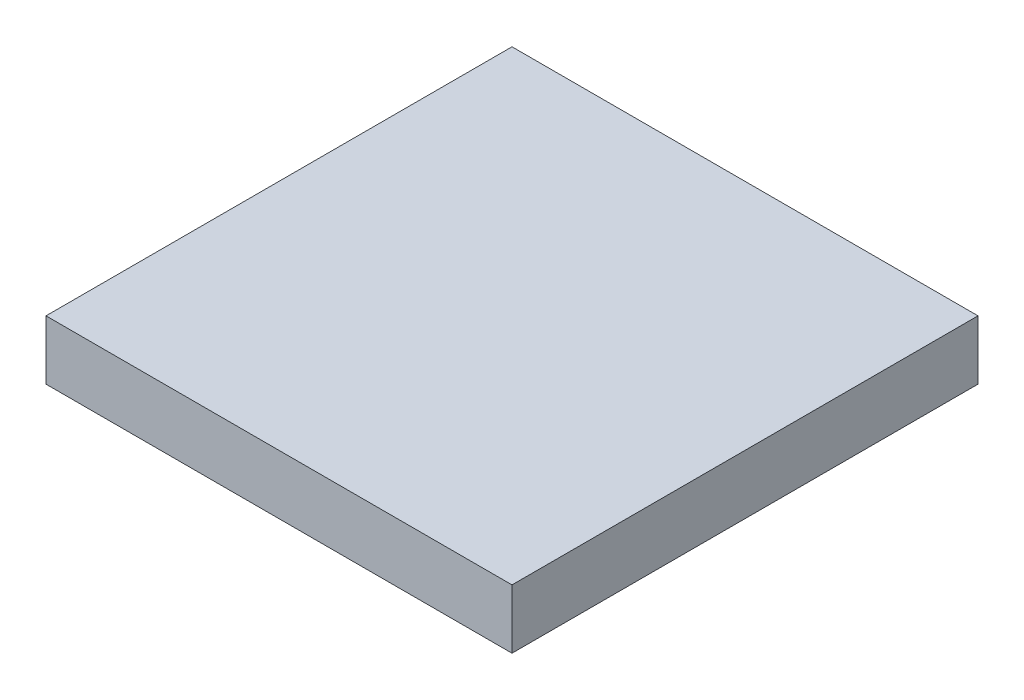
ISO-10303-21;
HEADER;
FILE_DESCRIPTION(('STEP AP214'),'2;1');
FILE_NAME('part.step','',(''),(''),'','','');
FILE_SCHEMA(('AUTOMOTIVE_DESIGN { 1 0 10303 214 1 1 1 1 }'));
ENDSEC;
DATA;
#1=APPLICATION_CONTEXT('core data for automotive mechanical design processes');
#2=APPLICATION_PROTOCOL_DEFINITION('international standard','automotive_design',2000,#1);
#3=PRODUCT_CONTEXT('',#1,'mechanical');
#4=PRODUCT('Part','Part','',(#3));
#5=PRODUCT_RELATED_PRODUCT_CATEGORY('part','',(#4));
#6=PRODUCT_DEFINITION_FORMATION('','',#4);
#7=PRODUCT_DEFINITION_CONTEXT('part definition',#1,'design');
#8=PRODUCT_DEFINITION('design','',#6,#7);
#9=PRODUCT_DEFINITION_SHAPE('','',#8);
#10=(LENGTH_UNIT() NAMED_UNIT(*) SI_UNIT(.MILLI.,.METRE.));
#11=(NAMED_UNIT(*) PLANE_ANGLE_UNIT() SI_UNIT($,.RADIAN.));
#12=(NAMED_UNIT(*) SI_UNIT($,.STERADIAN.) SOLID_ANGLE_UNIT());
#13=UNCERTAINTY_MEASURE_WITH_UNIT(LENGTH_MEASURE(1.E-05),#10,'distance_accuracy_value','');
#14=(GEOMETRIC_REPRESENTATION_CONTEXT(3) GLOBAL_UNCERTAINTY_ASSIGNED_CONTEXT((#13)) GLOBAL_UNIT_ASSIGNED_CONTEXT((#10,
#11,#12)) REPRESENTATION_CONTEXT('',''));
#15=CARTESIAN_POINT('',(0.,0.,0.));
#16=DIRECTION('',(0.,0.,1.));
#17=DIRECTION('',(1.,0.,0.));
#18=AXIS2_PLACEMENT_3D('',#15,#16,#17);
#19=CARTESIAN_POINT('',(50.,12.7,50.));
#20=DIRECTION('',(-1.,0.,0.));
#21=DIRECTION('',(0.,0.,1.));
#22=AXIS2_PLACEMENT_3D('',#19,#20,#21);
#23=PLANE('',#22);
#24=DIRECTION('',(0.,0.,-1.));
#25=VECTOR('',#24,1.);
#26=CARTESIAN_POINT('',(50.,0.,50.));
#27=LINE('',#26,#25);
#28=CARTESIAN_POINT('',(50.,0.,50.));
#29=VERTEX_POINT('',#28);
#30=CARTESIAN_POINT('',(50.,0.,-50.));
#31=VERTEX_POINT('',#30);
#32=EDGE_CURVE('E113',#29,#31,#27,.T.);
#33=ORIENTED_EDGE('',*,*,#32,.T.);
#34=DIRECTION('',(0.,-1.,0.));
#35=VECTOR('',#34,1.);
#36=CARTESIAN_POINT('',(50.,12.7,-50.));
#37=LINE('',#36,#35);
#38=CARTESIAN_POINT('',(50.,12.7,-50.));
#39=VERTEX_POINT('',#38);
#40=EDGE_CURVE('E11',#39,#31,#37,.T.);
#41=ORIENTED_EDGE('',*,*,#40,.F.);
#42=DIRECTION('',(0.,0.,-1.));
#43=VECTOR('',#42,1.);
#44=CARTESIAN_POINT('',(50.,12.7,50.));
#45=LINE('',#44,#43);
#46=CARTESIAN_POINT('',(50.,12.7,50.));
#47=VERTEX_POINT('',#46);
#48=EDGE_CURVE('E97',#47,#39,#45,.T.);
#49=ORIENTED_EDGE('',*,*,#48,.F.);
#50=DIRECTION('',(0.,-1.,0.));
#51=VECTOR('',#50,1.);
#52=CARTESIAN_POINT('',(50.,12.7,50.));
#53=LINE('',#52,#51);
#54=EDGE_CURVE('E109',#47,#29,#53,.T.);
#55=ORIENTED_EDGE('',*,*,#54,.T.);
#56=EDGE_LOOP('',(#33,#41,#49,#55));
#57=FACE_BOUND('',#56,.T.);
#58=ADVANCED_FACE('F45',(#57),#23,.F.);
#59=CARTESIAN_POINT('',(-50.,12.7,-50.));
#60=DIRECTION('',(0.,0.,1.));
#61=DIRECTION('',(1.,0.,0.));
#62=AXIS2_PLACEMENT_3D('',#59,#60,#61);
#63=PLANE('',#62);
#64=DIRECTION('',(-1.,0.,0.));
#65=VECTOR('',#64,1.);
#66=CARTESIAN_POINT('',(-50.,0.,-50.));
#67=LINE('',#66,#65);
#68=CARTESIAN_POINT('',(-50.,0.,-50.));
#69=VERTEX_POINT('',#68);
#70=EDGE_CURVE('E102',#31,#69,#67,.T.);
#71=ORIENTED_EDGE('',*,*,#70,.T.);
#72=DIRECTION('',(0.,-1.,0.));
#73=VECTOR('',#72,1.);
#74=CARTESIAN_POINT('',(-50.,12.7,-50.));
#75=LINE('',#74,#73);
#76=CARTESIAN_POINT('',(-50.,12.7,-50.));
#77=VERTEX_POINT('',#76);
#78=EDGE_CURVE('E54',#77,#69,#75,.T.);
#79=ORIENTED_EDGE('',*,*,#78,.F.);
#80=DIRECTION('',(-1.,0.,0.));
#81=VECTOR('',#80,1.);
#82=CARTESIAN_POINT('',(-50.,12.7,-50.));
#83=LINE('',#82,#81);
#84=EDGE_CURVE('E92',#39,#77,#83,.T.);
#85=ORIENTED_EDGE('',*,*,#84,.F.);
#86=ORIENTED_EDGE('',*,*,#40,.T.);
#87=EDGE_LOOP('',(#71,#79,#85,#86));
#88=FACE_BOUND('',#87,.T.);
#89=ADVANCED_FACE('F101',(#88),#63,.F.);
#90=CARTESIAN_POINT('',(-50.,12.7,50.));
#91=DIRECTION('',(1.,0.,0.));
#92=DIRECTION('',(0.,0.,-1.));
#93=AXIS2_PLACEMENT_3D('',#90,#91,#92);
#94=PLANE('',#93);
#95=DIRECTION('',(0.,0.,1.));
#96=VECTOR('',#95,1.);
#97=CARTESIAN_POINT('',(-50.,0.,50.));
#98=LINE('',#97,#96);
#99=CARTESIAN_POINT('',(-50.,0.,50.));
#100=VERTEX_POINT('',#99);
#101=EDGE_CURVE('E79',#69,#100,#98,.T.);
#102=ORIENTED_EDGE('',*,*,#101,.T.);
#103=DIRECTION('',(0.,-1.,0.));
#104=VECTOR('',#103,1.);
#105=CARTESIAN_POINT('',(-50.,12.7,50.));
#106=LINE('',#105,#104);
#107=CARTESIAN_POINT('',(-50.,12.7,50.));
#108=VERTEX_POINT('',#107);
#109=EDGE_CURVE('E104',#108,#100,#106,.T.);
#110=ORIENTED_EDGE('',*,*,#109,.F.);
#111=DIRECTION('',(0.,0.,1.));
#112=VECTOR('',#111,1.);
#113=CARTESIAN_POINT('',(-50.,12.7,50.));
#114=LINE('',#113,#112);
#115=EDGE_CURVE('E95',#77,#108,#114,.T.);
#116=ORIENTED_EDGE('',*,*,#115,.F.);
#117=ORIENTED_EDGE('',*,*,#78,.T.);
#118=EDGE_LOOP('',(#102,#110,#116,#117));
#119=FACE_BOUND('',#118,.T.);
#120=ADVANCED_FACE('F105',(#119),#94,.F.);
#121=CARTESIAN_POINT('',(-50.,12.7,50.));
#122=DIRECTION('',(0.,0.,-1.));
#123=DIRECTION('',(-1.,0.,0.));
#124=AXIS2_PLACEMENT_3D('',#121,#122,#123);
#125=PLANE('',#124);
#126=DIRECTION('',(1.,0.,0.));
#127=VECTOR('',#126,1.);
#128=CARTESIAN_POINT('',(-50.,0.,50.));
#129=LINE('',#128,#127);
#130=EDGE_CURVE('E85',#100,#29,#129,.T.);
#131=ORIENTED_EDGE('',*,*,#130,.T.);
#132=ORIENTED_EDGE('',*,*,#54,.F.);
#133=DIRECTION('',(1.,0.,0.));
#134=VECTOR('',#133,1.);
#135=CARTESIAN_POINT('',(-50.,12.7,50.));
#136=LINE('',#135,#134);
#137=EDGE_CURVE('E62',#108,#47,#136,.T.);
#138=ORIENTED_EDGE('',*,*,#137,.F.);
#139=ORIENTED_EDGE('',*,*,#109,.T.);
#140=EDGE_LOOP('',(#131,#132,#138,#139));
#141=FACE_BOUND('',#140,.T.);
#142=ADVANCED_FACE('F126',(#141),#125,.F.);
#143=CARTESIAN_POINT('',(0.,12.7,0.));
#144=DIRECTION('',(0.,-1.,0.));
#145=DIRECTION('',(0.,0.,-1.));
#146=AXIS2_PLACEMENT_3D('',#143,#144,#145);
#147=PLANE('',#146);
#148=ORIENTED_EDGE('',*,*,#48,.T.);
#149=ORIENTED_EDGE('',*,*,#84,.T.);
#150=ORIENTED_EDGE('',*,*,#115,.T.);
#151=ORIENTED_EDGE('',*,*,#137,.T.);
#152=EDGE_LOOP('',(#148,#149,#150,#151));
#153=FACE_BOUND('',#152,.T.);
#154=ADVANCED_FACE('F93',(#153),#147,.F.);
#155=CARTESIAN_POINT('',(0.,0.,0.));
#156=DIRECTION('',(0.,-1.,0.));
#157=DIRECTION('',(0.,0.,-1.));
#158=AXIS2_PLACEMENT_3D('',#155,#156,#157);
#159=PLANE('',#158);
#160=ORIENTED_EDGE('',*,*,#32,.F.);
#161=ORIENTED_EDGE('',*,*,#130,.F.);
#162=ORIENTED_EDGE('',*,*,#101,.F.);
#163=ORIENTED_EDGE('',*,*,#70,.F.);
#164=EDGE_LOOP('',(#160,#161,#162,#163));
#165=FACE_BOUND('',#164,.T.);
#166=ADVANCED_FACE('F129',(#165),#159,.T.);
#167=CLOSED_SHELL('',(#58,#89,#120,#142,#154,#166));
#168=MANIFOLD_SOLID_BREP('B2',#167);
#169=ADVANCED_BREP_SHAPE_REPRESENTATION('',(#18,#168),#14);
#170=SHAPE_DEFINITION_REPRESENTATION(#9,#169);
ENDSEC;
END-ISO-10303-21;
